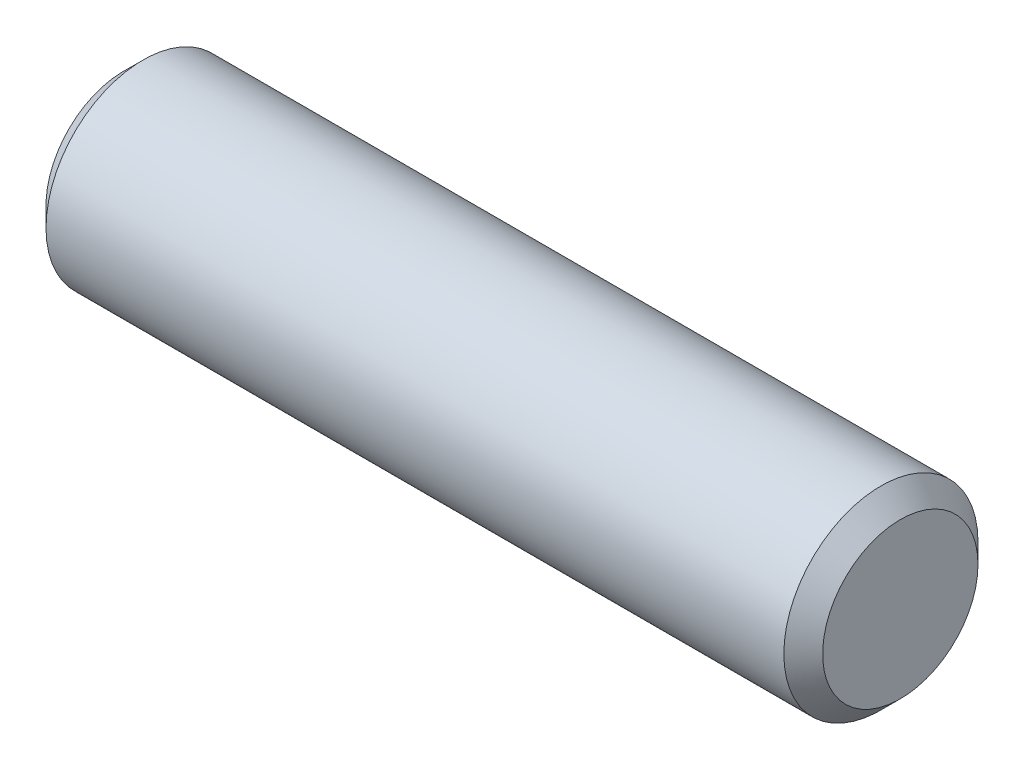
ISO-10303-21;
HEADER;
FILE_DESCRIPTION(('STEP AP214'),'2;1');
FILE_NAME('part.step','',(''),(''),'','','');
FILE_SCHEMA(('AUTOMOTIVE_DESIGN { 1 0 10303 214 1 1 1 1 }'));
ENDSEC;
DATA;
#1=APPLICATION_CONTEXT('core data for automotive mechanical design processes');
#2=APPLICATION_PROTOCOL_DEFINITION('international standard','automotive_design',2000,#1);
#3=PRODUCT_CONTEXT('',#1,'mechanical');
#4=PRODUCT('Part','Part','',(#3));
#5=PRODUCT_RELATED_PRODUCT_CATEGORY('part','',(#4));
#6=PRODUCT_DEFINITION_FORMATION('','',#4);
#7=PRODUCT_DEFINITION_CONTEXT('part definition',#1,'design');
#8=PRODUCT_DEFINITION('design','',#6,#7);
#9=PRODUCT_DEFINITION_SHAPE('','',#8);
#10=(LENGTH_UNIT() NAMED_UNIT(*) SI_UNIT(.MILLI.,.METRE.));
#11=(NAMED_UNIT(*) PLANE_ANGLE_UNIT() SI_UNIT($,.RADIAN.));
#12=(NAMED_UNIT(*) SI_UNIT($,.STERADIAN.) SOLID_ANGLE_UNIT());
#13=UNCERTAINTY_MEASURE_WITH_UNIT(LENGTH_MEASURE(1.E-05),#10,'distance_accuracy_value','');
#14=(GEOMETRIC_REPRESENTATION_CONTEXT(3) GLOBAL_UNCERTAINTY_ASSIGNED_CONTEXT((#13)) GLOBAL_UNIT_ASSIGNED_CONTEXT((#10,
#11,#12)) REPRESENTATION_CONTEXT('',''));
#15=CARTESIAN_POINT('',(0.,0.,0.));
#16=DIRECTION('',(0.,0.,1.));
#17=DIRECTION('',(1.,0.,0.));
#18=AXIS2_PLACEMENT_3D('',#15,#16,#17);
#19=CARTESIAN_POINT('',(-6.35,0.,0.));
#20=DIRECTION('',(1.,0.,0.));
#21=DIRECTION('',(0.,0.,-1.));
#22=AXIS2_PLACEMENT_3D('',#19,#20,#21);
#23=CYLINDRICAL_SURFACE('',#22,1.5875);
#24=CARTESIAN_POINT('',(6.0325,0.,0.));
#25=DIRECTION('',(1.,0.,0.));
#26=DIRECTION('',(0.,0.,-1.));
#27=AXIS2_PLACEMENT_3D('',#24,#25,#26);
#28=CIRCLE('',#27,1.5875);
#29=CARTESIAN_POINT('',(6.0325,0.,-1.5875));
#30=VERTEX_POINT('',#29);
#31=EDGE_CURVE('E37',#30,#30,#28,.F.);
#32=ORIENTED_EDGE('',*,*,#31,.T.);
#33=EDGE_LOOP('',(#32));
#34=FACE_BOUND('',#33,.T.);
#35=CARTESIAN_POINT('',(-6.0325,0.,0.));
#36=DIRECTION('',(1.,0.,0.));
#37=DIRECTION('',(0.,0.,-1.));
#38=AXIS2_PLACEMENT_3D('',#35,#36,#37);
#39=CIRCLE('',#38,1.5875);
#40=CARTESIAN_POINT('',(-6.0325,0.,-1.5875));
#41=VERTEX_POINT('',#40);
#42=EDGE_CURVE('E41',#41,#41,#39,.T.);
#43=ORIENTED_EDGE('',*,*,#42,.T.);
#44=EDGE_LOOP('',(#43));
#45=FACE_BOUND('',#44,.T.);
#46=ADVANCED_FACE('F30',(#34,#45),#23,.T.);
#47=CARTESIAN_POINT('',(-6.35,0.,0.));
#48=DIRECTION('',(1.,0.,0.));
#49=DIRECTION('',(0.,0.,-1.));
#50=AXIS2_PLACEMENT_3D('',#47,#48,#49);
#51=PLANE('',#50);
#52=CARTESIAN_POINT('',(-6.35,0.,0.));
#53=DIRECTION('',(1.,0.,0.));
#54=DIRECTION('',(0.,0.,-1.));
#55=AXIS2_PLACEMENT_3D('',#52,#53,#54);
#56=CIRCLE('',#55,1.27);
#57=CARTESIAN_POINT('',(-6.35,0.,-1.27));
#58=VERTEX_POINT('',#57);
#59=EDGE_CURVE('E10',#58,#58,#56,.F.);
#60=ORIENTED_EDGE('',*,*,#59,.T.);
#61=EDGE_LOOP('',(#60));
#62=FACE_BOUND('',#61,.T.);
#63=ADVANCED_FACE('F61',(#62),#51,.F.);
#64=CARTESIAN_POINT('',(6.35,0.,0.));
#65=DIRECTION('',(1.,0.,0.));
#66=DIRECTION('',(0.,0.,-1.));
#67=AXIS2_PLACEMENT_3D('',#64,#65,#66);
#68=PLANE('',#67);
#69=CARTESIAN_POINT('',(6.35,0.,0.));
#70=DIRECTION('',(1.,0.,0.));
#71=DIRECTION('',(0.,0.,-1.));
#72=AXIS2_PLACEMENT_3D('',#69,#70,#71);
#73=CIRCLE('',#72,1.27);
#74=CARTESIAN_POINT('',(6.35,0.,-1.27));
#75=VERTEX_POINT('',#74);
#76=EDGE_CURVE('E45',#75,#75,#73,.T.);
#77=ORIENTED_EDGE('',*,*,#76,.T.);
#78=EDGE_LOOP('',(#77));
#79=FACE_BOUND('',#78,.T.);
#80=ADVANCED_FACE('F51',(#79),#68,.T.);
#81=CARTESIAN_POINT('',(6.35,0.,0.));
#82=DIRECTION('',(-1.,0.,0.));
#83=DIRECTION('',(0.,0.,1.));
#84=AXIS2_PLACEMENT_3D('',#81,#82,#83);
#85=CONICAL_SURFACE('',#84,1.27,0.785398163397448);
#86=ORIENTED_EDGE('',*,*,#31,.F.);
#87=EDGE_LOOP('',(#86));
#88=FACE_BOUND('',#87,.T.);
#89=ORIENTED_EDGE('',*,*,#76,.F.);
#90=EDGE_LOOP('',(#89));
#91=FACE_BOUND('',#90,.T.);
#92=ADVANCED_FACE('F53',(#88,#91),#85,.T.);
#93=CARTESIAN_POINT('',(-6.0325,0.,0.));
#94=DIRECTION('',(1.,0.,0.));
#95=DIRECTION('',(0.,0.,-1.));
#96=AXIS2_PLACEMENT_3D('',#93,#94,#95);
#97=CONICAL_SURFACE('',#96,1.5875,0.78539816339745);
#98=ORIENTED_EDGE('',*,*,#59,.F.);
#99=EDGE_LOOP('',(#98));
#100=FACE_BOUND('',#99,.T.);
#101=ORIENTED_EDGE('',*,*,#42,.F.);
#102=EDGE_LOOP('',(#101));
#103=FACE_BOUND('',#102,.T.);
#104=ADVANCED_FACE('F32',(#100,#103),#97,.T.);
#105=CLOSED_SHELL('',(#46,#63,#80,#92,#104));
#106=MANIFOLD_SOLID_BREP('B2',#105);
#107=ADVANCED_BREP_SHAPE_REPRESENTATION('',(#18,#106),#14);
#108=SHAPE_DEFINITION_REPRESENTATION(#9,#107);
ENDSEC;
END-ISO-10303-21;
